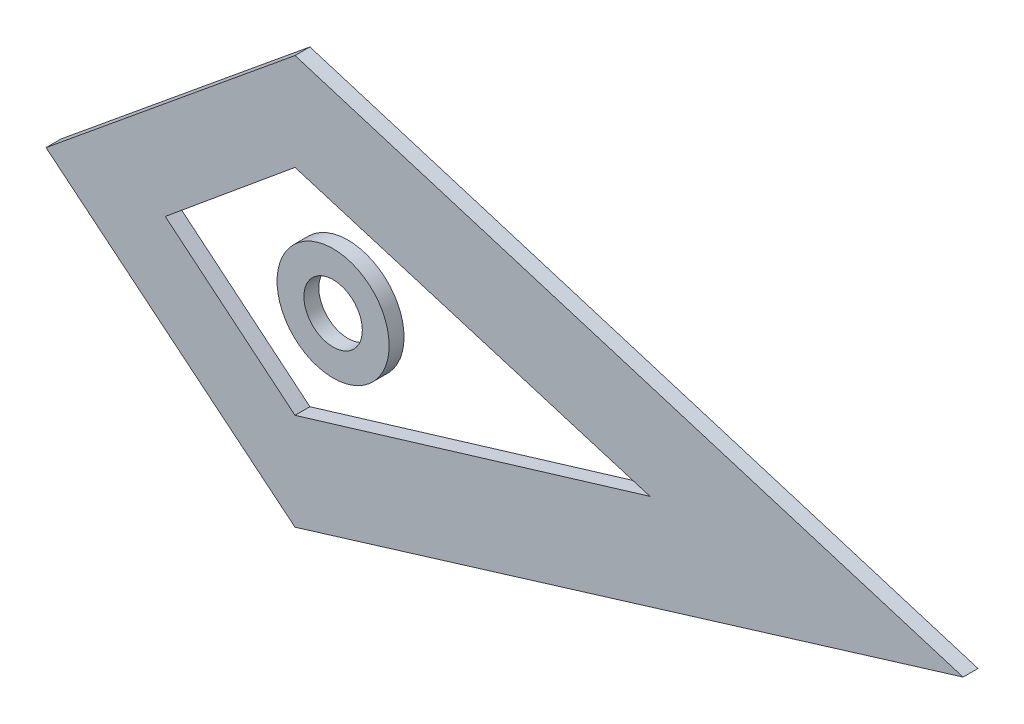
ISO-10303-21;
HEADER;
FILE_DESCRIPTION(('STEP AP214'),'2;1');
FILE_NAME('part.step','',(''),(''),'','','');
FILE_SCHEMA(('AUTOMOTIVE_DESIGN { 1 0 10303 214 1 1 1 1 }'));
ENDSEC;
DATA;
#1=APPLICATION_CONTEXT('core data for automotive mechanical design processes');
#2=APPLICATION_PROTOCOL_DEFINITION('international standard','automotive_design',2000,#1);
#3=PRODUCT_CONTEXT('',#1,'mechanical');
#4=PRODUCT('Part','Part','',(#3));
#5=PRODUCT_RELATED_PRODUCT_CATEGORY('part','',(#4));
#6=PRODUCT_DEFINITION_FORMATION('','',#4);
#7=PRODUCT_DEFINITION_CONTEXT('part definition',#1,'design');
#8=PRODUCT_DEFINITION('design','',#6,#7);
#9=PRODUCT_DEFINITION_SHAPE('','',#8);
#10=(LENGTH_UNIT() NAMED_UNIT(*) SI_UNIT(.MILLI.,.METRE.));
#11=(NAMED_UNIT(*) PLANE_ANGLE_UNIT() SI_UNIT($,.RADIAN.));
#12=(NAMED_UNIT(*) SI_UNIT($,.STERADIAN.) SOLID_ANGLE_UNIT());
#13=UNCERTAINTY_MEASURE_WITH_UNIT(LENGTH_MEASURE(1.E-05),#10,'distance_accuracy_value','');
#14=(GEOMETRIC_REPRESENTATION_CONTEXT(3) GLOBAL_UNCERTAINTY_ASSIGNED_CONTEXT((#13)) GLOBAL_UNIT_ASSIGNED_CONTEXT((#10,
#11,#12)) REPRESENTATION_CONTEXT('',''));
#15=CARTESIAN_POINT('',(0.,0.,0.));
#16=DIRECTION('',(0.,0.,1.));
#17=DIRECTION('',(1.,0.,0.));
#18=AXIS2_PLACEMENT_3D('',#15,#16,#17);
#19=CARTESIAN_POINT('',(0.,0.,2.54));
#20=DIRECTION('',(0.,0.,-1.));
#21=DIRECTION('',(-1.,0.,0.));
#22=AXIS2_PLACEMENT_3D('',#19,#20,#21);
#23=CYLINDRICAL_SURFACE('',#22,4.97452370176078);
#24=CARTESIAN_POINT('',(0.,0.,2.54));
#25=DIRECTION('',(0.,0.,1.));
#26=DIRECTION('',(1.,0.,0.));
#27=AXIS2_PLACEMENT_3D('',#24,#25,#26);
#28=CIRCLE('',#27,4.97452370176078);
#29=CARTESIAN_POINT('',(4.97452370176078,0.,2.54));
#30=VERTEX_POINT('',#29);
#31=EDGE_CURVE('E69',#30,#30,#28,.T.);
#32=ORIENTED_EDGE('',*,*,#31,.T.);
#33=EDGE_LOOP('',(#32));
#34=FACE_BOUND('',#33,.T.);
#35=CARTESIAN_POINT('',(0.,0.,0.));
#36=DIRECTION('',(0.,0.,1.));
#37=DIRECTION('',(1.,0.,0.));
#38=AXIS2_PLACEMENT_3D('',#35,#36,#37);
#39=CIRCLE('',#38,4.97452370176078);
#40=CARTESIAN_POINT('',(4.97452370176078,0.,0.));
#41=VERTEX_POINT('',#40);
#42=EDGE_CURVE('E75',#41,#41,#39,.T.);
#43=ORIENTED_EDGE('',*,*,#42,.F.);
#44=EDGE_LOOP('',(#43));
#45=FACE_BOUND('',#44,.T.);
#46=ADVANCED_FACE('F62',(#34,#45),#23,.F.);
#47=CARTESIAN_POINT('',(0.,0.,2.54));
#48=DIRECTION('',(0.,0.,-1.));
#49=DIRECTION('',(-1.,0.,0.));
#50=AXIS2_PLACEMENT_3D('',#47,#48,#49);
#51=CYLINDRICAL_SURFACE('',#50,9.54652370176078);
#52=CARTESIAN_POINT('',(0.,0.,2.54));
#53=DIRECTION('',(0.,0.,1.));
#54=DIRECTION('',(1.,0.,0.));
#55=AXIS2_PLACEMENT_3D('',#52,#53,#54);
#56=CIRCLE('',#55,9.54652370176078);
#57=CARTESIAN_POINT('',(9.54652370176078,0.,2.54));
#58=VERTEX_POINT('',#57);
#59=EDGE_CURVE('E12',#58,#58,#56,.T.);
#60=ORIENTED_EDGE('',*,*,#59,.F.);
#61=EDGE_LOOP('',(#60));
#62=FACE_BOUND('',#61,.T.);
#63=CARTESIAN_POINT('',(0.,0.,0.));
#64=DIRECTION('',(0.,0.,1.));
#65=DIRECTION('',(1.,0.,0.));
#66=AXIS2_PLACEMENT_3D('',#63,#64,#65);
#67=CIRCLE('',#66,9.54652370176078);
#68=CARTESIAN_POINT('',(9.54652370176078,0.,0.));
#69=VERTEX_POINT('',#68);
#70=EDGE_CURVE('E65',#69,#69,#67,.T.);
#71=ORIENTED_EDGE('',*,*,#70,.T.);
#72=EDGE_LOOP('',(#71));
#73=FACE_BOUND('',#72,.T.);
#74=ADVANCED_FACE('F82',(#62,#73),#51,.T.);
#75=CARTESIAN_POINT('',(0.,0.,2.54));
#76=DIRECTION('',(0.,0.,1.));
#77=DIRECTION('',(1.,0.,0.));
#78=AXIS2_PLACEMENT_3D('',#75,#76,#77);
#79=PLANE('',#78);
#80=ORIENTED_EDGE('',*,*,#31,.F.);
#81=EDGE_LOOP('',(#80));
#82=FACE_BOUND('',#81,.T.);
#83=ORIENTED_EDGE('',*,*,#59,.T.);
#84=EDGE_LOOP('',(#83));
#85=FACE_BOUND('',#84,.T.);
#86=ADVANCED_FACE('F86',(#82,#85),#79,.T.);
#87=CARTESIAN_POINT('',(0.,0.,0.));
#88=DIRECTION('',(0.,0.,1.));
#89=DIRECTION('',(1.,0.,0.));
#90=AXIS2_PLACEMENT_3D('',#87,#88,#89);
#91=PLANE('',#90);
#92=ORIENTED_EDGE('',*,*,#42,.T.);
#93=EDGE_LOOP('',(#92));
#94=FACE_BOUND('',#93,.T.);
#95=ORIENTED_EDGE('',*,*,#70,.F.);
#96=EDGE_LOOP('',(#95));
#97=FACE_BOUND('',#96,.T.);
#98=ADVANCED_FACE('F84',(#94,#97),#91,.F.);
#99=CLOSED_SHELL('',(#46,#74,#86,#98));
#100=MANIFOLD_SOLID_BREP('B2',#99);
#101=CARTESIAN_POINT('',(-11.6200655400572,-14.0451969184143,2.54));
#102=DIRECTION('',(0.637452263887145,0.77048985150043,0.));
#103=DIRECTION('',(-0.77048985150043,0.637452263887145,0.));
#104=AXIS2_PLACEMENT_3D('',#101,#102,#103);
#105=PLANE('',#104);
#106=DIRECTION('',(0.77048985150043,-0.637452263887145,0.));
#107=VECTOR('',#106,1.);
#108=CARTESIAN_POINT('',(-11.6200655400572,-14.0451969184143,0.));
#109=LINE('',#108,#107);
#110=CARTESIAN_POINT('',(-28.5965237017608,0.,0.));
#111=VERTEX_POINT('',#110);
#112=CARTESIAN_POINT('',(-6.49178080177401,-18.288,0.));
#113=VERTEX_POINT('',#112);
#114=EDGE_CURVE('E237',#111,#113,#109,.T.);
#115=ORIENTED_EDGE('',*,*,#114,.F.);
#116=DIRECTION('',(0.,0.,-1.));
#117=VECTOR('',#116,1.);
#118=CARTESIAN_POINT('',(-28.5965237017608,0.,2.54));
#119=LINE('',#118,#117);
#120=CARTESIAN_POINT('',(-28.5965237017608,0.,2.54));
#121=VERTEX_POINT('',#120);
#122=EDGE_CURVE('E60',#121,#111,#119,.T.);
#123=ORIENTED_EDGE('',*,*,#122,.F.);
#124=DIRECTION('',(0.77048985150043,-0.637452263887145,0.));
#125=VECTOR('',#124,1.);
#126=CARTESIAN_POINT('',(-11.6200655400572,-14.0451969184143,2.54));
#127=LINE('',#126,#125);
#128=CARTESIAN_POINT('',(-6.49178080177401,-18.288,2.54));
#129=VERTEX_POINT('',#128);
#130=EDGE_CURVE('E211',#121,#129,#127,.T.);
#131=ORIENTED_EDGE('',*,*,#130,.T.);
#132=DIRECTION('',(0.,0.,-1.));
#133=VECTOR('',#132,1.);
#134=CARTESIAN_POINT('',(-6.49178080177401,-18.288,2.54));
#135=LINE('',#134,#133);
#136=EDGE_CURVE('E177',#129,#113,#135,.T.);
#137=ORIENTED_EDGE('',*,*,#136,.T.);
#138=EDGE_LOOP('',(#115,#123,#131,#137));
#139=FACE_BOUND('',#138,.T.);
#140=ADVANCED_FACE('F124',(#139),#105,.T.);
#141=CARTESIAN_POINT('',(-11.6200655400572,14.0451969184143,2.54));
#142=DIRECTION('',(-0.637452263887145,0.770489851500429,0.));
#143=DIRECTION('',(-0.770489851500429,-0.637452263887145,0.));
#144=AXIS2_PLACEMENT_3D('',#141,#142,#143);
#145=PLANE('',#144);
#146=DIRECTION('',(0.77048985150043,0.637452263887145,0.));
#147=VECTOR('',#146,1.);
#148=CARTESIAN_POINT('',(-11.6200655400572,14.0451969184143,0.));
#149=LINE('',#148,#147);
#150=CARTESIAN_POINT('',(-6.49178080177401,18.288,0.));
#151=VERTEX_POINT('',#150);
#152=EDGE_CURVE('E216',#111,#151,#149,.T.);
#153=ORIENTED_EDGE('',*,*,#152,.T.);
#154=DIRECTION('',(0.,0.,-1.));
#155=VECTOR('',#154,1.);
#156=CARTESIAN_POINT('',(-6.49178080177401,18.288,2.54));
#157=LINE('',#156,#155);
#158=CARTESIAN_POINT('',(-6.49178080177401,18.288,2.54));
#159=VERTEX_POINT('',#158);
#160=EDGE_CURVE('E134',#159,#151,#157,.T.);
#161=ORIENTED_EDGE('',*,*,#160,.F.);
#162=DIRECTION('',(0.77048985150043,0.637452263887145,0.));
#163=VECTOR('',#162,1.);
#164=CARTESIAN_POINT('',(-11.6200655400572,14.0451969184143,2.54));
#165=LINE('',#164,#163);
#166=EDGE_CURVE('E207',#121,#159,#165,.T.);
#167=ORIENTED_EDGE('',*,*,#166,.F.);
#168=ORIENTED_EDGE('',*,*,#122,.T.);
#169=EDGE_LOOP('',(#153,#161,#167,#168));
#170=FACE_BOUND('',#169,.T.);
#171=ADVANCED_FACE('F214',(#170),#145,.F.);
#172=CARTESIAN_POINT('',(4.52238799342943,14.9579823944493,2.54));
#173=DIRECTION('',(0.289401654278066,0.957207753051091,0.));
#174=DIRECTION('',(-0.957207753051091,0.289401654278066,0.));
#175=AXIS2_PLACEMENT_3D('',#172,#173,#174);
#176=PLANE('',#175);
#177=DIRECTION('',(0.957207753051091,-0.289401654278066,0.));
#178=VECTOR('',#177,1.);
#179=CARTESIAN_POINT('',(4.52238799342943,14.9579823944493,0.));
#180=LINE('',#179,#178);
#181=CARTESIAN_POINT('',(53.9965237017608,0.,0.));
#182=VERTEX_POINT('',#181);
#183=EDGE_CURVE('E234',#151,#182,#180,.T.);
#184=ORIENTED_EDGE('',*,*,#183,.T.);
#185=DIRECTION('',(0.,0.,-1.));
#186=VECTOR('',#185,1.);
#187=CARTESIAN_POINT('',(53.9965237017608,0.,2.54));
#188=LINE('',#187,#186);
#189=CARTESIAN_POINT('',(53.9965237017608,0.,2.54));
#190=VERTEX_POINT('',#189);
#191=EDGE_CURVE('E206',#190,#182,#188,.T.);
#192=ORIENTED_EDGE('',*,*,#191,.F.);
#193=DIRECTION('',(0.957207753051091,-0.289401654278066,0.));
#194=VECTOR('',#193,1.);
#195=CARTESIAN_POINT('',(4.52238799342943,14.9579823944493,2.54));
#196=LINE('',#195,#194);
#197=EDGE_CURVE('E200',#159,#190,#196,.T.);
#198=ORIENTED_EDGE('',*,*,#197,.F.);
#199=ORIENTED_EDGE('',*,*,#160,.T.);
#200=EDGE_LOOP('',(#184,#192,#198,#199));
#201=FACE_BOUND('',#200,.T.);
#202=ADVANCED_FACE('F203',(#201),#176,.F.);
#203=CARTESIAN_POINT('',(-19.6737918236172,23.985733662418,2.54));
#204=DIRECTION('',(-0.634185404715115,0.773181008850014,0.));
#205=DIRECTION('',(-0.773181008850014,-0.634185404715115,0.));
#206=AXIS2_PLACEMENT_3D('',#203,#204,#205);
#207=PLANE('',#206);
#208=DIRECTION('',(0.773181008850015,0.634185404715115,0.));
#209=VECTOR('',#208,1.);
#210=CARTESIAN_POINT('',(-19.6737918236172,23.985733662418,0.));
#211=LINE('',#210,#209);
#212=CARTESIAN_POINT('',(-48.9165237017608,0.,0.));
#213=VERTEX_POINT('',#212);
#214=CARTESIAN_POINT('',(-6.49178080177401,34.798,0.));
#215=VERTEX_POINT('',#214);
#216=EDGE_CURVE('E248',#213,#215,#211,.T.);
#217=ORIENTED_EDGE('',*,*,#216,.F.);
#218=DIRECTION('',(0.,0.,-1.));
#219=VECTOR('',#218,1.);
#220=CARTESIAN_POINT('',(-48.9165237017608,0.,2.54));
#221=LINE('',#220,#219);
#222=CARTESIAN_POINT('',(-48.9165237017608,0.,2.54));
#223=VERTEX_POINT('',#222);
#224=EDGE_CURVE('E128',#223,#213,#221,.T.);
#225=ORIENTED_EDGE('',*,*,#224,.F.);
#226=DIRECTION('',(0.773181008850015,0.634185404715115,0.));
#227=VECTOR('',#226,1.);
#228=CARTESIAN_POINT('',(-19.6737918236172,23.985733662418,2.54));
#229=LINE('',#228,#227);
#230=CARTESIAN_POINT('',(-6.49178080177401,34.798,2.54));
#231=VERTEX_POINT('',#230);
#232=EDGE_CURVE('E233',#223,#231,#229,.T.);
#233=ORIENTED_EDGE('',*,*,#232,.T.);
#234=DIRECTION('',(0.,0.,-1.));
#235=VECTOR('',#234,1.);
#236=CARTESIAN_POINT('',(-6.49178080177401,34.798,2.54));
#237=LINE('',#236,#235);
#238=EDGE_CURVE('E221',#231,#215,#237,.T.);
#239=ORIENTED_EDGE('',*,*,#238,.T.);
#240=EDGE_LOOP('',(#217,#225,#233,#239));
#241=FACE_BOUND('',#240,.T.);
#242=ADVANCED_FACE('F126',(#241),#207,.T.);
#243=CARTESIAN_POINT('',(-19.6737918236172,-23.985733662418,2.54));
#244=DIRECTION('',(-0.634185404715115,-0.773181008850014,0.));
#245=DIRECTION('',(0.773181008850015,-0.634185404715115,0.));
#246=AXIS2_PLACEMENT_3D('',#243,#244,#245);
#247=PLANE('',#246);
#248=DIRECTION('',(-0.773181008850015,0.634185404715115,0.));
#249=VECTOR('',#248,1.);
#250=CARTESIAN_POINT('',(-19.6737918236172,-23.985733662418,0.));
#251=LINE('',#250,#249);
#252=CARTESIAN_POINT('',(-6.49178080177401,-34.798,0.));
#253=VERTEX_POINT('',#252);
#254=EDGE_CURVE('E245',#253,#213,#251,.T.);
#255=ORIENTED_EDGE('',*,*,#254,.F.);
#256=DIRECTION('',(0.,0.,-1.));
#257=VECTOR('',#256,1.);
#258=CARTESIAN_POINT('',(-6.49178080177401,-34.798,2.54));
#259=LINE('',#258,#257);
#260=CARTESIAN_POINT('',(-6.49178080177401,-34.798,2.54));
#261=VERTEX_POINT('',#260);
#262=EDGE_CURVE('E224',#261,#253,#259,.T.);
#263=ORIENTED_EDGE('',*,*,#262,.F.);
#264=DIRECTION('',(-0.773181008850015,0.634185404715115,0.));
#265=VECTOR('',#264,1.);
#266=CARTESIAN_POINT('',(-19.6737918236172,-23.985733662418,2.54));
#267=LINE('',#266,#265);
#268=EDGE_CURVE('E258',#261,#223,#267,.T.);
#269=ORIENTED_EDGE('',*,*,#268,.T.);
#270=ORIENTED_EDGE('',*,*,#224,.T.);
#271=EDGE_LOOP('',(#255,#263,#269,#270));
#272=FACE_BOUND('',#271,.T.);
#273=ADVANCED_FACE('F269',(#272),#247,.T.);
#274=CARTESIAN_POINT('',(9.17390366115747,-30.0089056678064,2.54));
#275=DIRECTION('',(0.292350152487735,-0.956311344876969,0.));
#276=DIRECTION('',(0.956311344876969,0.292350152487735,0.));
#277=AXIS2_PLACEMENT_3D('',#274,#275,#276);
#278=PLANE('',#277);
#279=DIRECTION('',(-0.956311344876969,-0.292350152487735,0.));
#280=VECTOR('',#279,1.);
#281=CARTESIAN_POINT('',(9.17390366115747,-30.0089056678064,0.));
#282=LINE('',#281,#280);
#283=CARTESIAN_POINT('',(107.336523701761,0.,0.));
#284=VERTEX_POINT('',#283);
#285=EDGE_CURVE('E242',#284,#253,#282,.T.);
#286=ORIENTED_EDGE('',*,*,#285,.F.);
#287=DIRECTION('',(0.,0.,-1.));
#288=VECTOR('',#287,1.);
#289=CARTESIAN_POINT('',(107.336523701761,0.,2.54));
#290=LINE('',#289,#288);
#291=CARTESIAN_POINT('',(107.336523701761,0.,2.54));
#292=VERTEX_POINT('',#291);
#293=EDGE_CURVE('E223',#292,#284,#290,.T.);
#294=ORIENTED_EDGE('',*,*,#293,.F.);
#295=DIRECTION('',(-0.956311344876969,-0.292350152487735,0.));
#296=VECTOR('',#295,1.);
#297=CARTESIAN_POINT('',(9.17390366115747,-30.0089056678064,2.54));
#298=LINE('',#297,#296);
#299=EDGE_CURVE('E256',#292,#261,#298,.T.);
#300=ORIENTED_EDGE('',*,*,#299,.T.);
#301=ORIENTED_EDGE('',*,*,#262,.T.);
#302=EDGE_LOOP('',(#286,#294,#300,#301));
#303=FACE_BOUND('',#302,.T.);
#304=ADVANCED_FACE('F270',(#303),#278,.T.);
#305=CARTESIAN_POINT('',(9.17390366115747,30.0089056678064,2.54));
#306=DIRECTION('',(0.292350152487735,0.956311344876969,0.));
#307=DIRECTION('',(-0.956311344876969,0.292350152487735,0.));
#308=AXIS2_PLACEMENT_3D('',#305,#306,#307);
#309=PLANE('',#308);
#310=DIRECTION('',(0.956311344876969,-0.292350152487735,0.));
#311=VECTOR('',#310,1.);
#312=CARTESIAN_POINT('',(9.17390366115747,30.0089056678064,0.));
#313=LINE('',#312,#311);
#314=EDGE_CURVE('E239',#215,#284,#313,.T.);
#315=ORIENTED_EDGE('',*,*,#314,.F.);
#316=ORIENTED_EDGE('',*,*,#238,.F.);
#317=DIRECTION('',(0.956311344876969,-0.292350152487735,0.));
#318=VECTOR('',#317,1.);
#319=CARTESIAN_POINT('',(9.17390366115747,30.0089056678064,2.54));
#320=LINE('',#319,#318);
#321=EDGE_CURVE('E253',#231,#292,#320,.T.);
#322=ORIENTED_EDGE('',*,*,#321,.T.);
#323=ORIENTED_EDGE('',*,*,#293,.T.);
#324=EDGE_LOOP('',(#315,#316,#322,#323));
#325=FACE_BOUND('',#324,.T.);
#326=ADVANCED_FACE('F266',(#325),#309,.T.);
#327=CARTESIAN_POINT('',(4.52238799342943,-14.9579823944493,2.54));
#328=DIRECTION('',(0.289401654278066,-0.957207753051091,0.));
#329=DIRECTION('',(0.957207753051091,0.289401654278066,0.));
#330=AXIS2_PLACEMENT_3D('',#327,#328,#329);
#331=PLANE('',#330);
#332=DIRECTION('',(-0.957207753051091,-0.289401654278066,0.));
#333=VECTOR('',#332,1.);
#334=CARTESIAN_POINT('',(4.52238799342943,-14.9579823944493,0.));
#335=LINE('',#334,#333);
#336=EDGE_CURVE('E170',#182,#113,#335,.T.);
#337=ORIENTED_EDGE('',*,*,#336,.T.);
#338=ORIENTED_EDGE('',*,*,#136,.F.);
#339=DIRECTION('',(-0.957207753051091,-0.289401654278066,0.));
#340=VECTOR('',#339,1.);
#341=CARTESIAN_POINT('',(4.52238799342943,-14.9579823944493,2.54));
#342=LINE('',#341,#340);
#343=EDGE_CURVE('E143',#190,#129,#342,.T.);
#344=ORIENTED_EDGE('',*,*,#343,.F.);
#345=ORIENTED_EDGE('',*,*,#191,.T.);
#346=EDGE_LOOP('',(#337,#338,#344,#345));
#347=FACE_BOUND('',#346,.T.);
#348=ADVANCED_FACE('F277',(#347),#331,.F.);
#349=CARTESIAN_POINT('',(0.,0.,2.54));
#350=DIRECTION('',(0.,0.,1.));
#351=DIRECTION('',(1.,0.,0.));
#352=AXIS2_PLACEMENT_3D('',#349,#350,#351);
#353=PLANE('',#352);
#354=ORIENTED_EDGE('',*,*,#232,.F.);
#355=ORIENTED_EDGE('',*,*,#268,.F.);
#356=ORIENTED_EDGE('',*,*,#299,.F.);
#357=ORIENTED_EDGE('',*,*,#321,.F.);
#358=EDGE_LOOP('',(#354,#355,#356,#357));
#359=FACE_BOUND('',#358,.T.);
#360=ORIENTED_EDGE('',*,*,#130,.F.);
#361=ORIENTED_EDGE('',*,*,#166,.T.);
#362=ORIENTED_EDGE('',*,*,#197,.T.);
#363=ORIENTED_EDGE('',*,*,#343,.T.);
#364=EDGE_LOOP('',(#360,#361,#362,#363));
#365=FACE_BOUND('',#364,.T.);
#366=ADVANCED_FACE('F210',(#359,#365),#353,.T.);
#367=CARTESIAN_POINT('',(0.,0.,0.));
#368=DIRECTION('',(0.,0.,1.));
#369=DIRECTION('',(1.,0.,0.));
#370=AXIS2_PLACEMENT_3D('',#367,#368,#369);
#371=PLANE('',#370);
#372=ORIENTED_EDGE('',*,*,#216,.T.);
#373=ORIENTED_EDGE('',*,*,#314,.T.);
#374=ORIENTED_EDGE('',*,*,#285,.T.);
#375=ORIENTED_EDGE('',*,*,#254,.T.);
#376=EDGE_LOOP('',(#372,#373,#374,#375));
#377=FACE_BOUND('',#376,.T.);
#378=ORIENTED_EDGE('',*,*,#114,.T.);
#379=ORIENTED_EDGE('',*,*,#336,.F.);
#380=ORIENTED_EDGE('',*,*,#183,.F.);
#381=ORIENTED_EDGE('',*,*,#152,.F.);
#382=EDGE_LOOP('',(#378,#379,#380,#381));
#383=FACE_BOUND('',#382,.T.);
#384=ADVANCED_FACE('F268',(#377,#383),#371,.F.);
#385=CLOSED_SHELL('',(#140,#171,#202,#242,#273,#304,#326,#348,#366,#384));
#386=MANIFOLD_SOLID_BREP('B7',#385);
#387=ADVANCED_BREP_SHAPE_REPRESENTATION('',(#18,#100,#386),#14);
#388=SHAPE_DEFINITION_REPRESENTATION(#9,#387);
ENDSEC;
END-ISO-10303-21;
